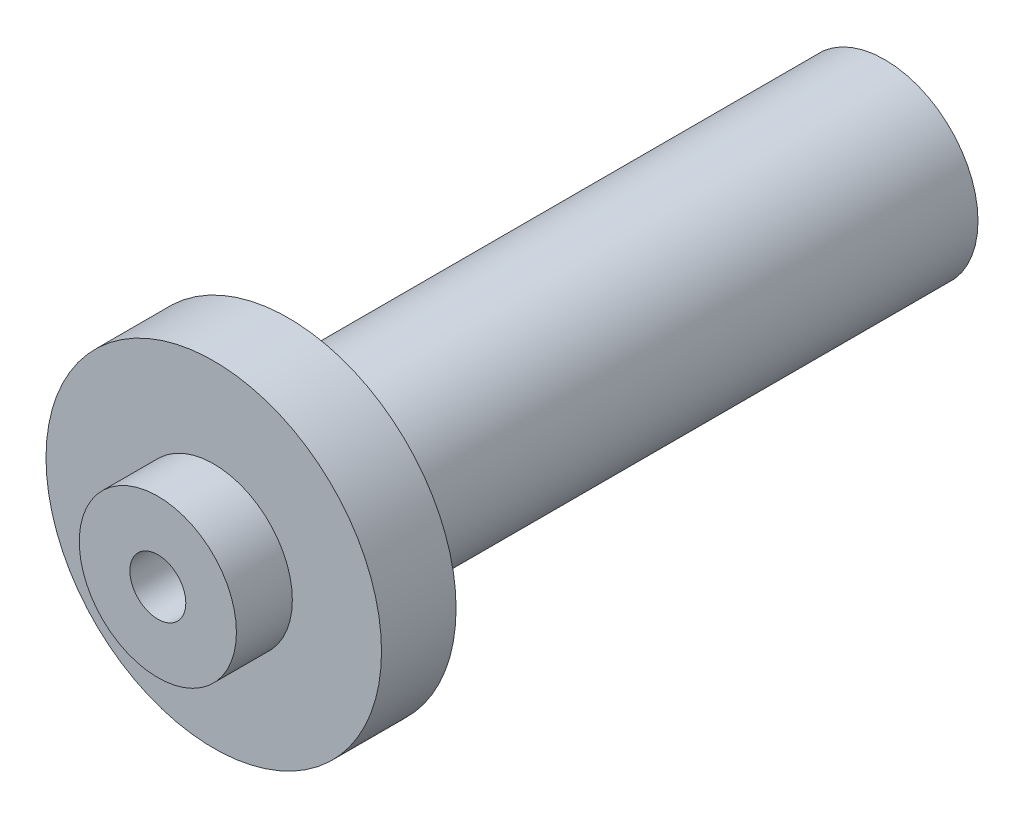
ISO-10303-21;
HEADER;
FILE_DESCRIPTION(('STEP AP214'),'2;1');
FILE_NAME('part.step','',(''),(''),'','','');
FILE_SCHEMA(('AUTOMOTIVE_DESIGN { 1 0 10303 214 1 1 1 1 }'));
ENDSEC;
DATA;
#1=APPLICATION_CONTEXT('core data for automotive mechanical design processes');
#2=APPLICATION_PROTOCOL_DEFINITION('international standard','automotive_design',2000,#1);
#3=PRODUCT_CONTEXT('',#1,'mechanical');
#4=PRODUCT('Part','Part','',(#3));
#5=PRODUCT_RELATED_PRODUCT_CATEGORY('part','',(#4));
#6=PRODUCT_DEFINITION_FORMATION('','',#4);
#7=PRODUCT_DEFINITION_CONTEXT('part definition',#1,'design');
#8=PRODUCT_DEFINITION('design','',#6,#7);
#9=PRODUCT_DEFINITION_SHAPE('','',#8);
#10=(LENGTH_UNIT() NAMED_UNIT(*) SI_UNIT(.MILLI.,.METRE.));
#11=(NAMED_UNIT(*) PLANE_ANGLE_UNIT() SI_UNIT($,.RADIAN.));
#12=(NAMED_UNIT(*) SI_UNIT($,.STERADIAN.) SOLID_ANGLE_UNIT());
#13=UNCERTAINTY_MEASURE_WITH_UNIT(LENGTH_MEASURE(1.E-05),#10,'distance_accuracy_value','');
#14=(GEOMETRIC_REPRESENTATION_CONTEXT(3) GLOBAL_UNCERTAINTY_ASSIGNED_CONTEXT((#13)) GLOBAL_UNIT_ASSIGNED_CONTEXT((#10,
#11,#12)) REPRESENTATION_CONTEXT('',''));
#15=CARTESIAN_POINT('',(0.,0.,0.));
#16=DIRECTION('',(0.,0.,1.));
#17=DIRECTION('',(1.,0.,0.));
#18=AXIS2_PLACEMENT_3D('',#15,#16,#17);
#19=CARTESIAN_POINT('',(0.,0.,203.2));
#20=DIRECTION('',(0.,0.,-1.));
#21=DIRECTION('',(-1.,0.,0.));
#22=AXIS2_PLACEMENT_3D('',#19,#20,#21);
#23=CYLINDRICAL_SURFACE('',#22,31.75);
#24=CARTESIAN_POINT('',(0.,0.,203.2));
#25=DIRECTION('',(0.,0.,1.));
#26=DIRECTION('',(1.,0.,0.));
#27=AXIS2_PLACEMENT_3D('',#24,#25,#26);
#28=CIRCLE('',#27,31.75);
#29=CARTESIAN_POINT('',(31.75,0.,203.2));
#30=VERTEX_POINT('',#29);
#31=EDGE_CURVE('E45',#30,#30,#28,.T.);
#32=ORIENTED_EDGE('',*,*,#31,.F.);
#33=EDGE_LOOP('',(#32));
#34=FACE_BOUND('',#33,.T.);
#35=CARTESIAN_POINT('',(0.,0.,0.));
#36=DIRECTION('',(0.,0.,1.));
#37=DIRECTION('',(1.,0.,0.));
#38=AXIS2_PLACEMENT_3D('',#35,#36,#37);
#39=CIRCLE('',#38,31.75);
#40=CARTESIAN_POINT('',(31.75,0.,0.));
#41=VERTEX_POINT('',#40);
#42=EDGE_CURVE('E40',#41,#41,#39,.T.);
#43=ORIENTED_EDGE('',*,*,#42,.T.);
#44=EDGE_LOOP('',(#43));
#45=FACE_BOUND('',#44,.T.);
#46=ADVANCED_FACE('F37',(#34,#45),#23,.T.);
#47=CARTESIAN_POINT('',(0.,0.,0.));
#48=DIRECTION('',(0.,0.,1.));
#49=DIRECTION('',(1.,0.,0.));
#50=AXIS2_PLACEMENT_3D('',#47,#48,#49);
#51=PLANE('',#50);
#52=CARTESIAN_POINT('',(0.,0.,0.));
#53=DIRECTION('',(0.,0.,1.));
#54=DIRECTION('',(1.,0.,0.));
#55=AXIS2_PLACEMENT_3D('',#52,#53,#54);
#56=CIRCLE('',#55,9.525);
#57=CARTESIAN_POINT('',(9.525,0.,0.));
#58=VERTEX_POINT('',#57);
#59=EDGE_CURVE('E66',#58,#58,#56,.T.);
#60=ORIENTED_EDGE('',*,*,#59,.T.);
#61=EDGE_LOOP('',(#60));
#62=FACE_BOUND('',#61,.T.);
#63=ORIENTED_EDGE('',*,*,#42,.F.);
#64=EDGE_LOOP('',(#63));
#65=FACE_BOUND('',#64,.T.);
#66=ADVANCED_FACE('F95',(#62,#65),#51,.F.);
#67=CARTESIAN_POINT('',(0.,0.,228.6));
#68=DIRECTION('',(0.,0.,-1.));
#69=DIRECTION('',(-1.,0.,0.));
#70=AXIS2_PLACEMENT_3D('',#67,#68,#69);
#71=CYLINDRICAL_SURFACE('',#70,57.15);
#72=CARTESIAN_POINT('',(0.,0.,228.6));
#73=DIRECTION('',(0.,0.,1.));
#74=DIRECTION('',(1.,0.,0.));
#75=AXIS2_PLACEMENT_3D('',#72,#73,#74);
#76=CIRCLE('',#75,57.15);
#77=CARTESIAN_POINT('',(57.15,0.,228.6));
#78=VERTEX_POINT('',#77);
#79=EDGE_CURVE('E55',#78,#78,#76,.T.);
#80=ORIENTED_EDGE('',*,*,#79,.F.);
#81=EDGE_LOOP('',(#80));
#82=FACE_BOUND('',#81,.T.);
#83=CARTESIAN_POINT('',(0.,0.,203.2));
#84=DIRECTION('',(0.,0.,1.));
#85=DIRECTION('',(1.,0.,0.));
#86=AXIS2_PLACEMENT_3D('',#83,#84,#85);
#87=CIRCLE('',#86,57.15);
#88=CARTESIAN_POINT('',(57.15,0.,203.2));
#89=VERTEX_POINT('',#88);
#90=EDGE_CURVE('E59',#89,#89,#87,.T.);
#91=ORIENTED_EDGE('',*,*,#90,.T.);
#92=EDGE_LOOP('',(#91));
#93=FACE_BOUND('',#92,.T.);
#94=ADVANCED_FACE('F100',(#82,#93),#71,.T.);
#95=CARTESIAN_POINT('',(0.,0.,228.6));
#96=DIRECTION('',(0.,0.,1.));
#97=DIRECTION('',(1.,0.,0.));
#98=AXIS2_PLACEMENT_3D('',#95,#96,#97);
#99=PLANE('',#98);
#100=CARTESIAN_POINT('',(0.,0.,228.6));
#101=DIRECTION('',(0.,0.,1.));
#102=DIRECTION('',(1.,0.,0.));
#103=AXIS2_PLACEMENT_3D('',#100,#101,#102);
#104=CIRCLE('',#103,26.7716);
#105=CARTESIAN_POINT('',(26.7716,0.,228.6));
#106=VERTEX_POINT('',#105);
#107=EDGE_CURVE('E10',#106,#106,#104,.T.);
#108=ORIENTED_EDGE('',*,*,#107,.F.);
#109=EDGE_LOOP('',(#108));
#110=FACE_BOUND('',#109,.T.);
#111=ORIENTED_EDGE('',*,*,#79,.T.);
#112=EDGE_LOOP('',(#111));
#113=FACE_BOUND('',#112,.T.);
#114=ADVANCED_FACE('F110',(#110,#113),#99,.T.);
#115=CARTESIAN_POINT('',(0.,0.,203.2));
#116=DIRECTION('',(0.,0.,1.));
#117=DIRECTION('',(1.,0.,0.));
#118=AXIS2_PLACEMENT_3D('',#115,#116,#117);
#119=PLANE('',#118);
#120=ORIENTED_EDGE('',*,*,#31,.T.);
#121=EDGE_LOOP('',(#120));
#122=FACE_BOUND('',#121,.T.);
#123=ORIENTED_EDGE('',*,*,#90,.F.);
#124=EDGE_LOOP('',(#123));
#125=FACE_BOUND('',#124,.T.);
#126=ADVANCED_FACE('F91',(#122,#125),#119,.F.);
#127=CARTESIAN_POINT('',(0.,0.,247.65));
#128=DIRECTION('',(0.,0.,-1.));
#129=DIRECTION('',(-1.,0.,0.));
#130=AXIS2_PLACEMENT_3D('',#127,#128,#129);
#131=CYLINDRICAL_SURFACE('',#130,26.7716);
#132=CARTESIAN_POINT('',(0.,0.,247.65));
#133=DIRECTION('',(0.,0.,1.));
#134=DIRECTION('',(1.,0.,0.));
#135=AXIS2_PLACEMENT_3D('',#132,#133,#134);
#136=CIRCLE('',#135,26.7716);
#137=CARTESIAN_POINT('',(26.7716,0.,247.65));
#138=VERTEX_POINT('',#137);
#139=EDGE_CURVE('E53',#138,#138,#136,.T.);
#140=ORIENTED_EDGE('',*,*,#139,.F.);
#141=EDGE_LOOP('',(#140));
#142=FACE_BOUND('',#141,.T.);
#143=ORIENTED_EDGE('',*,*,#107,.T.);
#144=EDGE_LOOP('',(#143));
#145=FACE_BOUND('',#144,.T.);
#146=ADVANCED_FACE('F83',(#142,#145),#131,.T.);
#147=CARTESIAN_POINT('',(0.,0.,247.65));
#148=DIRECTION('',(0.,0.,1.));
#149=DIRECTION('',(1.,0.,0.));
#150=AXIS2_PLACEMENT_3D('',#147,#148,#149);
#151=PLANE('',#150);
#152=CARTESIAN_POINT('',(0.,0.,247.65));
#153=DIRECTION('',(0.,0.,1.));
#154=DIRECTION('',(1.,0.,0.));
#155=AXIS2_PLACEMENT_3D('',#152,#153,#154);
#156=CIRCLE('',#155,9.525);
#157=CARTESIAN_POINT('',(9.525,0.,247.65));
#158=VERTEX_POINT('',#157);
#159=EDGE_CURVE('E71',#158,#158,#156,.T.);
#160=ORIENTED_EDGE('',*,*,#159,.F.);
#161=EDGE_LOOP('',(#160));
#162=FACE_BOUND('',#161,.T.);
#163=ORIENTED_EDGE('',*,*,#139,.T.);
#164=EDGE_LOOP('',(#163));
#165=FACE_BOUND('',#164,.T.);
#166=ADVANCED_FACE('F81',(#162,#165),#151,.T.);
#167=CARTESIAN_POINT('',(0.,0.,0.));
#168=DIRECTION('',(0.,0.,1.));
#169=DIRECTION('',(1.,0.,0.));
#170=AXIS2_PLACEMENT_3D('',#167,#168,#169);
#171=CYLINDRICAL_SURFACE('',#170,9.525);
#172=ORIENTED_EDGE('',*,*,#59,.F.);
#173=EDGE_LOOP('',(#172));
#174=FACE_BOUND('',#173,.T.);
#175=ORIENTED_EDGE('',*,*,#159,.T.);
#176=EDGE_LOOP('',(#175));
#177=FACE_BOUND('',#176,.T.);
#178=ADVANCED_FACE('F79',(#174,#177),#171,.F.);
#179=CLOSED_SHELL('',(#46,#66,#94,#114,#126,#146,#166,#178));
#180=MANIFOLD_SOLID_BREP('B2',#179);
#181=ADVANCED_BREP_SHAPE_REPRESENTATION('',(#18,#180),#14);
#182=SHAPE_DEFINITION_REPRESENTATION(#9,#181);
ENDSEC;
END-ISO-10303-21;
